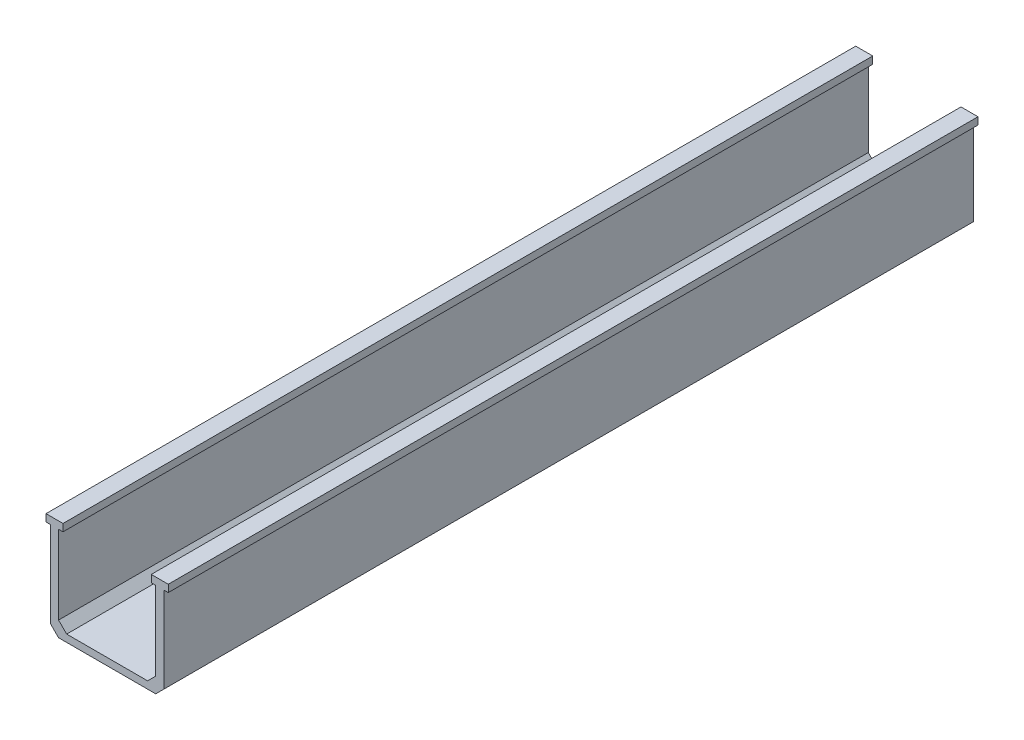
ISO-10303-21;
HEADER;
FILE_DESCRIPTION(('STEP AP214'),'2;1');
FILE_NAME('part.step','',(''),(''),'','','');
FILE_SCHEMA(('AUTOMOTIVE_DESIGN { 1 0 10303 214 1 1 1 1 }'));
ENDSEC;
DATA;
#1=APPLICATION_CONTEXT('core data for automotive mechanical design processes');
#2=APPLICATION_PROTOCOL_DEFINITION('international standard','automotive_design',2000,#1);
#3=PRODUCT_CONTEXT('',#1,'mechanical');
#4=PRODUCT('Part','Part','',(#3));
#5=PRODUCT_RELATED_PRODUCT_CATEGORY('part','',(#4));
#6=PRODUCT_DEFINITION_FORMATION('','',#4);
#7=PRODUCT_DEFINITION_CONTEXT('part definition',#1,'design');
#8=PRODUCT_DEFINITION('design','',#6,#7);
#9=PRODUCT_DEFINITION_SHAPE('','',#8);
#10=(LENGTH_UNIT() NAMED_UNIT(*) SI_UNIT(.MILLI.,.METRE.));
#11=(NAMED_UNIT(*) PLANE_ANGLE_UNIT() SI_UNIT($,.RADIAN.));
#12=(NAMED_UNIT(*) SI_UNIT($,.STERADIAN.) SOLID_ANGLE_UNIT());
#13=UNCERTAINTY_MEASURE_WITH_UNIT(LENGTH_MEASURE(1.E-05),#10,'distance_accuracy_value','');
#14=(GEOMETRIC_REPRESENTATION_CONTEXT(3) GLOBAL_UNCERTAINTY_ASSIGNED_CONTEXT((#13)) GLOBAL_UNIT_ASSIGNED_CONTEXT((#10,
#11,#12)) REPRESENTATION_CONTEXT('',''));
#15=CARTESIAN_POINT('',(0.,0.,0.));
#16=DIRECTION('',(0.,0.,1.));
#17=DIRECTION('',(1.,0.,0.));
#18=AXIS2_PLACEMENT_3D('',#15,#16,#17);
#19=CARTESIAN_POINT('',(0.,10.7142857142857,200.));
#20=DIRECTION('',(0.,-1.,0.));
#21=DIRECTION('',(0.,0.,-1.));
#22=AXIS2_PLACEMENT_3D('',#19,#20,#21);
#23=PLANE('',#22);
#24=DIRECTION('',(-1.,0.,0.));
#25=VECTOR('',#24,1.);
#26=CARTESIAN_POINT('',(0.,10.7142857142857,0.));
#27=LINE('',#26,#25);
#28=CARTESIAN_POINT('',(-14.,10.7142857142857,0.));
#29=VERTEX_POINT('',#28);
#30=CARTESIAN_POINT('',(-15.100215679252,10.7142857142857,0.));
#31=VERTEX_POINT('',#30);
#32=EDGE_CURVE('E188',#29,#31,#27,.T.);
#33=ORIENTED_EDGE('',*,*,#32,.F.);
#34=DIRECTION('',(0.,0.,-1.));
#35=VECTOR('',#34,1.);
#36=CARTESIAN_POINT('',(-14.,10.7142857142857,200.));
#37=LINE('',#36,#35);
#38=CARTESIAN_POINT('',(-14.,10.7142857142857,200.));
#39=VERTEX_POINT('',#38);
#40=EDGE_CURVE('E174',#39,#29,#37,.T.);
#41=ORIENTED_EDGE('',*,*,#40,.F.);
#42=DIRECTION('',(-1.,0.,0.));
#43=VECTOR('',#42,1.);
#44=CARTESIAN_POINT('',(0.,10.7142857142857,200.));
#45=LINE('',#44,#43);
#46=CARTESIAN_POINT('',(-15.100215679252,10.7142857142857,200.));
#47=VERTEX_POINT('',#46);
#48=EDGE_CURVE('E182',#39,#47,#45,.T.);
#49=ORIENTED_EDGE('',*,*,#48,.T.);
#50=DIRECTION('',(0.,0.,-1.));
#51=VECTOR('',#50,1.);
#52=CARTESIAN_POINT('',(-15.100215679252,10.7142857142857,200.));
#53=LINE('',#52,#51);
#54=EDGE_CURVE('E237',#47,#31,#53,.T.);
#55=ORIENTED_EDGE('',*,*,#54,.T.);
#56=EDGE_LOOP('',(#33,#41,#49,#55));
#57=FACE_BOUND('',#56,.T.);
#58=ADVANCED_FACE('F34',(#57),#23,.T.);
#59=CARTESIAN_POINT('',(-14.0000000000001,1.39140835605427E-13,200.));
#60=DIRECTION('',(-1.,0.,0.));
#61=DIRECTION('',(0.,-1.,0.));
#62=AXIS2_PLACEMENT_3D('',#59,#60,#61);
#63=PLANE('',#62);
#64=DIRECTION('',(0.,1.,0.));
#65=VECTOR('',#64,1.);
#66=CARTESIAN_POINT('',(-14.0000000000001,1.39140835605427E-13,0.));
#67=LINE('',#66,#65);
#68=CARTESIAN_POINT('',(-14.0000000000002,-10.5,0.));
#69=VERTEX_POINT('',#68);
#70=EDGE_CURVE('E239',#69,#29,#67,.T.);
#71=ORIENTED_EDGE('',*,*,#70,.F.);
#72=DIRECTION('',(0.,0.,1.));
#73=VECTOR('',#72,1.);
#74=CARTESIAN_POINT('',(-14.0000000000002,-10.5,200.));
#75=LINE('',#74,#73);
#76=CARTESIAN_POINT('',(-14.0000000000002,-10.5,200.));
#77=VERTEX_POINT('',#76);
#78=EDGE_CURVE('E177',#69,#77,#75,.T.);
#79=ORIENTED_EDGE('',*,*,#78,.T.);
#80=DIRECTION('',(0.,1.,0.));
#81=VECTOR('',#80,1.);
#82=CARTESIAN_POINT('',(-14.0000000000001,1.39140835605427E-13,200.));
#83=LINE('',#82,#81);
#84=EDGE_CURVE('E170',#77,#39,#83,.T.);
#85=ORIENTED_EDGE('',*,*,#84,.T.);
#86=ORIENTED_EDGE('',*,*,#40,.T.);
#87=EDGE_LOOP('',(#71,#79,#85,#86));
#88=FACE_BOUND('',#87,.T.);
#89=ADVANCED_FACE('F173',(#88),#63,.T.);
#90=CARTESIAN_POINT('',(0.,-12.5,200.));
#91=DIRECTION('',(0.,1.,0.));
#92=DIRECTION('',(-1.,0.,0.));
#93=AXIS2_PLACEMENT_3D('',#90,#91,#92);
#94=PLANE('',#93);
#95=CARTESIAN_POINT('',(-1.07119396054503E-13,-12.5,24.9996189974107));
#96=DIRECTION('',(0.,1.,0.));
#97=DIRECTION('',(-1.,0.,0.));
#98=AXIS2_PLACEMENT_3D('',#95,#96,#97);
#99=CIRCLE('',#98,3.);
#100=CARTESIAN_POINT('',(-3.00000000000011,-12.5,24.9996189974107));
#101=VERTEX_POINT('',#100);
#102=EDGE_CURVE('E202',#101,#101,#99,.T.);
#103=ORIENTED_EDGE('',*,*,#102,.T.);
#104=EDGE_LOOP('',(#103));
#105=FACE_BOUND('',#104,.T.);
#106=CARTESIAN_POINT('',(-1.07119396054503E-13,-12.5,175.000381002589));
#107=DIRECTION('',(0.,1.,0.));
#108=DIRECTION('',(-1.,0.,0.));
#109=AXIS2_PLACEMENT_3D('',#106,#107,#108);
#110=CIRCLE('',#109,3.);
#111=CARTESIAN_POINT('',(-3.00000000000011,-12.5,175.000381002589));
#112=VERTEX_POINT('',#111);
#113=EDGE_CURVE('E322',#112,#112,#110,.T.);
#114=ORIENTED_EDGE('',*,*,#113,.T.);
#115=EDGE_LOOP('',(#114));
#116=FACE_BOUND('',#115,.T.);
#117=CARTESIAN_POINT('',(0.,-12.5,100.));
#118=DIRECTION('',(0.,1.,0.));
#119=DIRECTION('',(-1.,0.,0.));
#120=AXIS2_PLACEMENT_3D('',#117,#118,#119);
#121=CIRCLE('',#120,3.);
#122=CARTESIAN_POINT('',(-3.00000000000006,-12.5,100.));
#123=VERTEX_POINT('',#122);
#124=EDGE_CURVE('E318',#123,#123,#121,.T.);
#125=ORIENTED_EDGE('',*,*,#124,.T.);
#126=EDGE_LOOP('',(#125));
#127=FACE_BOUND('',#126,.T.);
#128=DIRECTION('',(1.,0.,0.));
#129=VECTOR('',#128,1.);
#130=CARTESIAN_POINT('',(0.,-12.5,200.));
#131=LINE('',#130,#129);
#132=CARTESIAN_POINT('',(-12.0000000000003,-12.5,200.));
#133=VERTEX_POINT('',#132);
#134=CARTESIAN_POINT('',(12.,-12.5,200.));
#135=VERTEX_POINT('',#134);
#136=EDGE_CURVE('E181',#133,#135,#131,.T.);
#137=ORIENTED_EDGE('',*,*,#136,.F.);
#138=DIRECTION('',(0.,0.,-1.));
#139=VECTOR('',#138,1.);
#140=CARTESIAN_POINT('',(-12.0000000000003,-12.5,0.));
#141=LINE('',#140,#139);
#142=CARTESIAN_POINT('',(-12.0000000000003,-12.5,0.));
#143=VERTEX_POINT('',#142);
#144=EDGE_CURVE('E299',#133,#143,#141,.T.);
#145=ORIENTED_EDGE('',*,*,#144,.T.);
#146=DIRECTION('',(1.,0.,0.));
#147=VECTOR('',#146,1.);
#148=CARTESIAN_POINT('',(0.,-12.5,0.));
#149=LINE('',#148,#147);
#150=CARTESIAN_POINT('',(12.,-12.5,0.));
#151=VERTEX_POINT('',#150);
#152=EDGE_CURVE('E241',#143,#151,#149,.T.);
#153=ORIENTED_EDGE('',*,*,#152,.T.);
#154=DIRECTION('',(0.,0.,1.));
#155=VECTOR('',#154,1.);
#156=CARTESIAN_POINT('',(12.,-12.5,200.));
#157=LINE('',#156,#155);
#158=EDGE_CURVE('E189',#151,#135,#157,.T.);
#159=ORIENTED_EDGE('',*,*,#158,.T.);
#160=EDGE_LOOP('',(#137,#145,#153,#159));
#161=FACE_BOUND('',#160,.T.);
#162=ADVANCED_FACE('F369',(#105,#116,#127,#161),#94,.F.);
#163=CARTESIAN_POINT('',(14.,0.,200.));
#164=DIRECTION('',(-1.,0.,0.));
#165=DIRECTION('',(0.,0.,1.));
#166=AXIS2_PLACEMENT_3D('',#163,#164,#165);
#167=PLANE('',#166);
#168=DIRECTION('',(0.,1.,0.));
#169=VECTOR('',#168,1.);
#170=CARTESIAN_POINT('',(14.,0.,200.));
#171=LINE('',#170,#169);
#172=CARTESIAN_POINT('',(14.,-10.5,200.));
#173=VERTEX_POINT('',#172);
#174=CARTESIAN_POINT('',(14.,10.7142857142857,200.));
#175=VERTEX_POINT('',#174);
#176=EDGE_CURVE('E207',#173,#175,#171,.T.);
#177=ORIENTED_EDGE('',*,*,#176,.F.);
#178=DIRECTION('',(0.,0.,-1.));
#179=VECTOR('',#178,1.);
#180=CARTESIAN_POINT('',(14.,-10.5,200.));
#181=LINE('',#180,#179);
#182=CARTESIAN_POINT('',(14.,-10.5,0.));
#183=VERTEX_POINT('',#182);
#184=EDGE_CURVE('E311',#173,#183,#181,.T.);
#185=ORIENTED_EDGE('',*,*,#184,.T.);
#186=DIRECTION('',(0.,1.,0.));
#187=VECTOR('',#186,1.);
#188=CARTESIAN_POINT('',(14.,0.,0.));
#189=LINE('',#188,#187);
#190=CARTESIAN_POINT('',(14.,10.7142857142857,0.));
#191=VERTEX_POINT('',#190);
#192=EDGE_CURVE('E244',#183,#191,#189,.T.);
#193=ORIENTED_EDGE('',*,*,#192,.T.);
#194=DIRECTION('',(0.,0.,-1.));
#195=VECTOR('',#194,1.);
#196=CARTESIAN_POINT('',(14.,10.7142857142857,200.));
#197=LINE('',#196,#195);
#198=EDGE_CURVE('E190',#175,#191,#197,.T.);
#199=ORIENTED_EDGE('',*,*,#198,.F.);
#200=EDGE_LOOP('',(#177,#185,#193,#199));
#201=FACE_BOUND('',#200,.T.);
#202=ADVANCED_FACE('F405',(#201),#167,.F.);
#203=CARTESIAN_POINT('',(0.,10.7142857142857,200.));
#204=DIRECTION('',(0.,1.,0.));
#205=DIRECTION('',(-1.,0.,0.));
#206=AXIS2_PLACEMENT_3D('',#203,#204,#205);
#207=PLANE('',#206);
#208=DIRECTION('',(1.,0.,0.));
#209=VECTOR('',#208,1.);
#210=CARTESIAN_POINT('',(0.,10.7142857142857,0.));
#211=LINE('',#210,#209);
#212=CARTESIAN_POINT('',(15.100215679252,10.7142857142857,0.));
#213=VERTEX_POINT('',#212);
#214=EDGE_CURVE('E246',#191,#213,#211,.T.);
#215=ORIENTED_EDGE('',*,*,#214,.T.);
#216=DIRECTION('',(0.,0.,-1.));
#217=VECTOR('',#216,1.);
#218=CARTESIAN_POINT('',(15.100215679252,10.7142857142857,200.));
#219=LINE('',#218,#217);
#220=CARTESIAN_POINT('',(15.100215679252,10.7142857142857,200.));
#221=VERTEX_POINT('',#220);
#222=EDGE_CURVE('E293',#221,#213,#219,.T.);
#223=ORIENTED_EDGE('',*,*,#222,.F.);
#224=DIRECTION('',(1.,0.,0.));
#225=VECTOR('',#224,1.);
#226=CARTESIAN_POINT('',(0.,10.7142857142857,200.));
#227=LINE('',#226,#225);
#228=EDGE_CURVE('E209',#175,#221,#227,.T.);
#229=ORIENTED_EDGE('',*,*,#228,.F.);
#230=ORIENTED_EDGE('',*,*,#198,.T.);
#231=EDGE_LOOP('',(#215,#223,#229,#230));
#232=FACE_BOUND('',#231,.T.);
#233=ADVANCED_FACE('F411',(#232),#207,.F.);
#234=CARTESIAN_POINT('',(15.100215679252,0.,200.));
#235=DIRECTION('',(-1.,0.,0.));
#236=DIRECTION('',(0.,-1.,0.));
#237=AXIS2_PLACEMENT_3D('',#234,#235,#236);
#238=PLANE('',#237);
#239=DIRECTION('',(0.,1.,0.));
#240=VECTOR('',#239,1.);
#241=CARTESIAN_POINT('',(15.100215679252,0.,0.));
#242=LINE('',#241,#240);
#243=CARTESIAN_POINT('',(15.100215679252,12.5,0.));
#244=VERTEX_POINT('',#243);
#245=EDGE_CURVE('E248',#213,#244,#242,.T.);
#246=ORIENTED_EDGE('',*,*,#245,.T.);
#247=DIRECTION('',(0.,0.,-1.));
#248=VECTOR('',#247,1.);
#249=CARTESIAN_POINT('',(15.100215679252,12.5,200.));
#250=LINE('',#249,#248);
#251=CARTESIAN_POINT('',(15.100215679252,12.5,200.));
#252=VERTEX_POINT('',#251);
#253=EDGE_CURVE('E291',#252,#244,#250,.T.);
#254=ORIENTED_EDGE('',*,*,#253,.F.);
#255=DIRECTION('',(0.,1.,0.));
#256=VECTOR('',#255,1.);
#257=CARTESIAN_POINT('',(15.100215679252,0.,200.));
#258=LINE('',#257,#256);
#259=EDGE_CURVE('E211',#221,#252,#258,.T.);
#260=ORIENTED_EDGE('',*,*,#259,.F.);
#261=ORIENTED_EDGE('',*,*,#222,.T.);
#262=EDGE_LOOP('',(#246,#254,#260,#261));
#263=FACE_BOUND('',#262,.T.);
#264=ADVANCED_FACE('F417',(#263),#238,.F.);
#265=CARTESIAN_POINT('',(0.,12.5,200.));
#266=DIRECTION('',(0.,1.,0.));
#267=DIRECTION('',(-1.,0.,0.));
#268=AXIS2_PLACEMENT_3D('',#265,#266,#267);
#269=PLANE('',#268);
#270=DIRECTION('',(1.,0.,0.));
#271=VECTOR('',#270,1.);
#272=CARTESIAN_POINT('',(0.,12.5,0.));
#273=LINE('',#272,#271);
#274=CARTESIAN_POINT('',(10.899784320748,12.5,0.));
#275=VERTEX_POINT('',#274);
#276=EDGE_CURVE('E251',#275,#244,#273,.T.);
#277=ORIENTED_EDGE('',*,*,#276,.F.);
#278=DIRECTION('',(0.,0.,-1.));
#279=VECTOR('',#278,1.);
#280=CARTESIAN_POINT('',(10.899784320748,12.5,200.));
#281=LINE('',#280,#279);
#282=CARTESIAN_POINT('',(10.899784320748,12.5,200.));
#283=VERTEX_POINT('',#282);
#284=EDGE_CURVE('E289',#283,#275,#281,.T.);
#285=ORIENTED_EDGE('',*,*,#284,.F.);
#286=DIRECTION('',(1.,0.,0.));
#287=VECTOR('',#286,1.);
#288=CARTESIAN_POINT('',(0.,12.5,200.));
#289=LINE('',#288,#287);
#290=EDGE_CURVE('E213',#283,#252,#289,.T.);
#291=ORIENTED_EDGE('',*,*,#290,.T.);
#292=ORIENTED_EDGE('',*,*,#253,.T.);
#293=EDGE_LOOP('',(#277,#285,#291,#292));
#294=FACE_BOUND('',#293,.T.);
#295=ADVANCED_FACE('F421',(#294),#269,.T.);
#296=CARTESIAN_POINT('',(10.8997843207481,0.,200.));
#297=DIRECTION('',(-1.,0.,0.));
#298=DIRECTION('',(0.,-1.,0.));
#299=AXIS2_PLACEMENT_3D('',#296,#297,#298);
#300=PLANE('',#299);
#301=DIRECTION('',(0.,1.,0.));
#302=VECTOR('',#301,1.);
#303=CARTESIAN_POINT('',(10.8997843207481,0.,0.));
#304=LINE('',#303,#302);
#305=CARTESIAN_POINT('',(10.899784320748,10.7142857142857,0.));
#306=VERTEX_POINT('',#305);
#307=EDGE_CURVE('E254',#306,#275,#304,.T.);
#308=ORIENTED_EDGE('',*,*,#307,.F.);
#309=DIRECTION('',(0.,0.,-1.));
#310=VECTOR('',#309,1.);
#311=CARTESIAN_POINT('',(10.899784320748,10.7142857142857,200.));
#312=LINE('',#311,#310);
#313=CARTESIAN_POINT('',(10.899784320748,10.7142857142857,200.));
#314=VERTEX_POINT('',#313);
#315=EDGE_CURVE('E287',#314,#306,#312,.T.);
#316=ORIENTED_EDGE('',*,*,#315,.F.);
#317=DIRECTION('',(0.,1.,0.));
#318=VECTOR('',#317,1.);
#319=CARTESIAN_POINT('',(10.8997843207481,0.,200.));
#320=LINE('',#319,#318);
#321=EDGE_CURVE('E216',#314,#283,#320,.T.);
#322=ORIENTED_EDGE('',*,*,#321,.T.);
#323=ORIENTED_EDGE('',*,*,#284,.T.);
#324=EDGE_LOOP('',(#308,#316,#322,#323));
#325=FACE_BOUND('',#324,.T.);
#326=ADVANCED_FACE('F424',(#325),#300,.T.);
#327=CARTESIAN_POINT('',(2.02720139049807E-13,10.7142857142859,200.));
#328=DIRECTION('',(0.,1.,0.));
#329=DIRECTION('',(-1.,0.,0.));
#330=AXIS2_PLACEMENT_3D('',#327,#328,#329);
#331=PLANE('',#330);
#332=DIRECTION('',(1.,0.,0.));
#333=VECTOR('',#332,1.);
#334=CARTESIAN_POINT('',(2.02720139049807E-13,10.7142857142859,0.));
#335=LINE('',#334,#333);
#336=CARTESIAN_POINT('',(12.,10.7142857142857,0.));
#337=VERTEX_POINT('',#336);
#338=EDGE_CURVE('E257',#306,#337,#335,.T.);
#339=ORIENTED_EDGE('',*,*,#338,.T.);
#340=DIRECTION('',(0.,0.,-1.));
#341=VECTOR('',#340,1.);
#342=CARTESIAN_POINT('',(12.,10.7142857142857,200.));
#343=LINE('',#342,#341);
#344=CARTESIAN_POINT('',(12.,10.7142857142857,200.));
#345=VERTEX_POINT('',#344);
#346=EDGE_CURVE('E284',#345,#337,#343,.T.);
#347=ORIENTED_EDGE('',*,*,#346,.F.);
#348=DIRECTION('',(1.,0.,0.));
#349=VECTOR('',#348,1.);
#350=CARTESIAN_POINT('',(2.02720139049807E-13,10.7142857142859,200.));
#351=LINE('',#350,#349);
#352=EDGE_CURVE('E219',#314,#345,#351,.T.);
#353=ORIENTED_EDGE('',*,*,#352,.F.);
#354=ORIENTED_EDGE('',*,*,#315,.T.);
#355=EDGE_LOOP('',(#339,#347,#353,#354));
#356=FACE_BOUND('',#355,.T.);
#357=ADVANCED_FACE('F428',(#356),#331,.F.);
#358=CARTESIAN_POINT('',(12.,0.,200.));
#359=DIRECTION('',(-1.,0.,0.));
#360=DIRECTION('',(0.,0.,1.));
#361=AXIS2_PLACEMENT_3D('',#358,#359,#360);
#362=PLANE('',#361);
#363=DIRECTION('',(0.,1.,0.));
#364=VECTOR('',#363,1.);
#365=CARTESIAN_POINT('',(12.,0.,0.));
#366=LINE('',#365,#364);
#367=CARTESIAN_POINT('',(12.,-8.71428571428572,0.));
#368=VERTEX_POINT('',#367);
#369=EDGE_CURVE('E260',#368,#337,#366,.T.);
#370=ORIENTED_EDGE('',*,*,#369,.F.);
#371=DIRECTION('',(0.,0.,1.));
#372=VECTOR('',#371,1.);
#373=CARTESIAN_POINT('',(12.,-8.71428571428572,200.));
#374=LINE('',#373,#372);
#375=CARTESIAN_POINT('',(12.,-8.71428571428572,200.));
#376=VERTEX_POINT('',#375);
#377=EDGE_CURVE('E50',#368,#376,#374,.T.);
#378=ORIENTED_EDGE('',*,*,#377,.T.);
#379=DIRECTION('',(0.,1.,0.));
#380=VECTOR('',#379,1.);
#381=CARTESIAN_POINT('',(12.,0.,200.));
#382=LINE('',#381,#380);
#383=EDGE_CURVE('E222',#376,#345,#382,.T.);
#384=ORIENTED_EDGE('',*,*,#383,.T.);
#385=ORIENTED_EDGE('',*,*,#346,.T.);
#386=EDGE_LOOP('',(#370,#378,#384,#385));
#387=FACE_BOUND('',#386,.T.);
#388=ADVANCED_FACE('F430',(#387),#362,.T.);
#389=CARTESIAN_POINT('',(0.,-10.7142857142857,200.));
#390=DIRECTION('',(0.,1.,0.));
#391=DIRECTION('',(0.,0.,1.));
#392=AXIS2_PLACEMENT_3D('',#389,#390,#391);
#393=PLANE('',#392);
#394=CARTESIAN_POINT('',(-1.06344965931299E-13,-10.7142857142857,24.9996189974107));
#395=DIRECTION('',(0.,1.,0.));
#396=DIRECTION('',(0.,0.,1.));
#397=AXIS2_PLACEMENT_3D('',#394,#395,#396);
#398=CIRCLE('',#397,3.);
#399=CARTESIAN_POINT('',(-1.06344965931299E-13,-10.7142857142857,27.9996189974107));
#400=VERTEX_POINT('',#399);
#401=EDGE_CURVE('E323',#400,#400,#398,.T.);
#402=ORIENTED_EDGE('',*,*,#401,.F.);
#403=EDGE_LOOP('',(#402));
#404=FACE_BOUND('',#403,.T.);
#405=CARTESIAN_POINT('',(-1.06344965931299E-13,-10.7142857142857,175.000381002589));
#406=DIRECTION('',(0.,1.,0.));
#407=DIRECTION('',(0.,0.,1.));
#408=AXIS2_PLACEMENT_3D('',#405,#406,#407);
#409=CIRCLE('',#408,3.);
#410=CARTESIAN_POINT('',(-1.06344965931299E-13,-10.7142857142857,178.000381002589));
#411=VERTEX_POINT('',#410);
#412=EDGE_CURVE('E319',#411,#411,#409,.T.);
#413=ORIENTED_EDGE('',*,*,#412,.F.);
#414=EDGE_LOOP('',(#413));
#415=FACE_BOUND('',#414,.T.);
#416=CARTESIAN_POINT('',(0.,-10.7142857142857,100.));
#417=DIRECTION('',(0.,1.,0.));
#418=DIRECTION('',(0.,0.,1.));
#419=AXIS2_PLACEMENT_3D('',#416,#417,#418);
#420=CIRCLE('',#419,3.);
#421=CARTESIAN_POINT('',(0.,-10.7142857142857,103.));
#422=VERTEX_POINT('',#421);
#423=EDGE_CURVE('E315',#422,#422,#420,.T.);
#424=ORIENTED_EDGE('',*,*,#423,.F.);
#425=EDGE_LOOP('',(#424));
#426=FACE_BOUND('',#425,.T.);
#427=DIRECTION('',(1.,0.,0.));
#428=VECTOR('',#427,1.);
#429=CARTESIAN_POINT('',(0.,-10.7142857142857,200.));
#430=LINE('',#429,#428);
#431=CARTESIAN_POINT('',(-10.,-10.7142857142857,200.));
#432=VERTEX_POINT('',#431);
#433=CARTESIAN_POINT('',(10.,-10.7142857142857,200.));
#434=VERTEX_POINT('',#433);
#435=EDGE_CURVE('E224',#432,#434,#430,.T.);
#436=ORIENTED_EDGE('',*,*,#435,.T.);
#437=DIRECTION('',(0.,0.,-1.));
#438=VECTOR('',#437,1.);
#439=CARTESIAN_POINT('',(10.,-10.7142857142857,0.));
#440=LINE('',#439,#438);
#441=CARTESIAN_POINT('',(10.,-10.7142857142857,0.));
#442=VERTEX_POINT('',#441);
#443=EDGE_CURVE('E334',#434,#442,#440,.T.);
#444=ORIENTED_EDGE('',*,*,#443,.T.);
#445=DIRECTION('',(1.,0.,0.));
#446=VECTOR('',#445,1.);
#447=CARTESIAN_POINT('',(0.,-10.7142857142857,0.));
#448=LINE('',#447,#446);
#449=CARTESIAN_POINT('',(-10.,-10.7142857142857,0.));
#450=VERTEX_POINT('',#449);
#451=EDGE_CURVE('E262',#450,#442,#448,.T.);
#452=ORIENTED_EDGE('',*,*,#451,.F.);
#453=DIRECTION('',(0.,0.,1.));
#454=VECTOR('',#453,1.);
#455=CARTESIAN_POINT('',(-10.,-10.7142857142857,200.));
#456=LINE('',#455,#454);
#457=EDGE_CURVE('E328',#450,#432,#456,.T.);
#458=ORIENTED_EDGE('',*,*,#457,.T.);
#459=EDGE_LOOP('',(#436,#444,#452,#458));
#460=FACE_BOUND('',#459,.T.);
#461=ADVANCED_FACE('F340',(#404,#415,#426,#460),#393,.T.);
#462=CARTESIAN_POINT('',(-12.,0.,200.));
#463=DIRECTION('',(-1.,0.,0.));
#464=DIRECTION('',(0.,0.,1.));
#465=AXIS2_PLACEMENT_3D('',#462,#463,#464);
#466=PLANE('',#465);
#467=DIRECTION('',(0.,1.,0.));
#468=VECTOR('',#467,1.);
#469=CARTESIAN_POINT('',(-12.,0.,200.));
#470=LINE('',#469,#468);
#471=CARTESIAN_POINT('',(-12.,-8.71428571428572,200.));
#472=VERTEX_POINT('',#471);
#473=CARTESIAN_POINT('',(-12.,10.7142857142857,200.));
#474=VERTEX_POINT('',#473);
#475=EDGE_CURVE('E227',#472,#474,#470,.T.);
#476=ORIENTED_EDGE('',*,*,#475,.F.);
#477=DIRECTION('',(0.,0.,-1.));
#478=VECTOR('',#477,1.);
#479=CARTESIAN_POINT('',(-12.,-8.71428571428572,200.));
#480=LINE('',#479,#478);
#481=CARTESIAN_POINT('',(-12.,-8.71428571428572,0.));
#482=VERTEX_POINT('',#481);
#483=EDGE_CURVE('E314',#472,#482,#480,.T.);
#484=ORIENTED_EDGE('',*,*,#483,.T.);
#485=DIRECTION('',(0.,1.,0.));
#486=VECTOR('',#485,1.);
#487=CARTESIAN_POINT('',(-12.,0.,0.));
#488=LINE('',#487,#486);
#489=CARTESIAN_POINT('',(-12.,10.7142857142857,0.));
#490=VERTEX_POINT('',#489);
#491=EDGE_CURVE('E264',#482,#490,#488,.T.);
#492=ORIENTED_EDGE('',*,*,#491,.T.);
#493=DIRECTION('',(0.,0.,-1.));
#494=VECTOR('',#493,1.);
#495=CARTESIAN_POINT('',(-12.,10.7142857142857,200.));
#496=LINE('',#495,#494);
#497=EDGE_CURVE('E281',#474,#490,#496,.T.);
#498=ORIENTED_EDGE('',*,*,#497,.F.);
#499=EDGE_LOOP('',(#476,#484,#492,#498));
#500=FACE_BOUND('',#499,.T.);
#501=ADVANCED_FACE('F355',(#500),#466,.F.);
#502=CARTESIAN_POINT('',(0.,10.7142857142857,200.));
#503=DIRECTION('',(0.,1.,0.));
#504=DIRECTION('',(0.,0.,1.));
#505=AXIS2_PLACEMENT_3D('',#502,#503,#504);
#506=PLANE('',#505);
#507=DIRECTION('',(1.,0.,0.));
#508=VECTOR('',#507,1.);
#509=CARTESIAN_POINT('',(0.,10.7142857142857,0.));
#510=LINE('',#509,#508);
#511=CARTESIAN_POINT('',(-10.899784320748,10.7142857142857,0.));
#512=VERTEX_POINT('',#511);
#513=EDGE_CURVE('E266',#490,#512,#510,.T.);
#514=ORIENTED_EDGE('',*,*,#513,.T.);
#515=DIRECTION('',(0.,0.,-1.));
#516=VECTOR('',#515,1.);
#517=CARTESIAN_POINT('',(-10.899784320748,10.7142857142857,200.));
#518=LINE('',#517,#516);
#519=CARTESIAN_POINT('',(-10.899784320748,10.7142857142857,200.));
#520=VERTEX_POINT('',#519);
#521=EDGE_CURVE('E278',#520,#512,#518,.T.);
#522=ORIENTED_EDGE('',*,*,#521,.F.);
#523=DIRECTION('',(1.,0.,0.));
#524=VECTOR('',#523,1.);
#525=CARTESIAN_POINT('',(0.,10.7142857142857,200.));
#526=LINE('',#525,#524);
#527=EDGE_CURVE('E229',#474,#520,#526,.T.);
#528=ORIENTED_EDGE('',*,*,#527,.F.);
#529=ORIENTED_EDGE('',*,*,#497,.T.);
#530=EDGE_LOOP('',(#514,#522,#528,#529));
#531=FACE_BOUND('',#530,.T.);
#532=ADVANCED_FACE('F445',(#531),#506,.F.);
#533=CARTESIAN_POINT('',(-10.899784320748,0.,200.));
#534=DIRECTION('',(-1.,0.,0.));
#535=DIRECTION('',(0.,0.,1.));
#536=AXIS2_PLACEMENT_3D('',#533,#534,#535);
#537=PLANE('',#536);
#538=DIRECTION('',(0.,1.,0.));
#539=VECTOR('',#538,1.);
#540=CARTESIAN_POINT('',(-10.899784320748,0.,0.));
#541=LINE('',#540,#539);
#542=CARTESIAN_POINT('',(-10.899784320748,12.5,0.));
#543=VERTEX_POINT('',#542);
#544=EDGE_CURVE('E268',#512,#543,#541,.T.);
#545=ORIENTED_EDGE('',*,*,#544,.T.);
#546=DIRECTION('',(0.,0.,-1.));
#547=VECTOR('',#546,1.);
#548=CARTESIAN_POINT('',(-10.899784320748,12.5,200.));
#549=LINE('',#548,#547);
#550=CARTESIAN_POINT('',(-10.899784320748,12.5,200.));
#551=VERTEX_POINT('',#550);
#552=EDGE_CURVE('E276',#551,#543,#549,.T.);
#553=ORIENTED_EDGE('',*,*,#552,.F.);
#554=DIRECTION('',(0.,1.,0.));
#555=VECTOR('',#554,1.);
#556=CARTESIAN_POINT('',(-10.899784320748,0.,200.));
#557=LINE('',#556,#555);
#558=EDGE_CURVE('E231',#520,#551,#557,.T.);
#559=ORIENTED_EDGE('',*,*,#558,.F.);
#560=ORIENTED_EDGE('',*,*,#521,.T.);
#561=EDGE_LOOP('',(#545,#553,#559,#560));
#562=FACE_BOUND('',#561,.T.);
#563=ADVANCED_FACE('F442',(#562),#537,.F.);
#564=CARTESIAN_POINT('',(0.,12.5,200.));
#565=DIRECTION('',(0.,1.,0.));
#566=DIRECTION('',(0.,0.,1.));
#567=AXIS2_PLACEMENT_3D('',#564,#565,#566);
#568=PLANE('',#567);
#569=DIRECTION('',(1.,0.,0.));
#570=VECTOR('',#569,1.);
#571=CARTESIAN_POINT('',(0.,12.5,0.));
#572=LINE('',#571,#570);
#573=CARTESIAN_POINT('',(-15.100215679252,12.5,0.));
#574=VERTEX_POINT('',#573);
#575=EDGE_CURVE('E199',#574,#543,#572,.T.);
#576=ORIENTED_EDGE('',*,*,#575,.F.);
#577=DIRECTION('',(0.,0.,-1.));
#578=VECTOR('',#577,1.);
#579=CARTESIAN_POINT('',(-15.100215679252,12.5,200.));
#580=LINE('',#579,#578);
#581=CARTESIAN_POINT('',(-15.100215679252,12.5,200.));
#582=VERTEX_POINT('',#581);
#583=EDGE_CURVE('E274',#582,#574,#580,.T.);
#584=ORIENTED_EDGE('',*,*,#583,.F.);
#585=DIRECTION('',(1.,0.,0.));
#586=VECTOR('',#585,1.);
#587=CARTESIAN_POINT('',(0.,12.5,200.));
#588=LINE('',#587,#586);
#589=EDGE_CURVE('E233',#582,#551,#588,.T.);
#590=ORIENTED_EDGE('',*,*,#589,.T.);
#591=ORIENTED_EDGE('',*,*,#552,.T.);
#592=EDGE_LOOP('',(#576,#584,#590,#591));
#593=FACE_BOUND('',#592,.T.);
#594=ADVANCED_FACE('F438',(#593),#568,.T.);
#595=CARTESIAN_POINT('',(-15.100215679252,0.,200.));
#596=DIRECTION('',(-1.,0.,0.));
#597=DIRECTION('',(0.,0.,1.));
#598=AXIS2_PLACEMENT_3D('',#595,#596,#597);
#599=PLANE('',#598);
#600=DIRECTION('',(0.,1.,0.));
#601=VECTOR('',#600,1.);
#602=CARTESIAN_POINT('',(-15.100215679252,0.,0.));
#603=LINE('',#602,#601);
#604=EDGE_CURVE('E196',#31,#574,#603,.T.);
#605=ORIENTED_EDGE('',*,*,#604,.F.);
#606=ORIENTED_EDGE('',*,*,#54,.F.);
#607=DIRECTION('',(0.,1.,0.));
#608=VECTOR('',#607,1.);
#609=CARTESIAN_POINT('',(-15.100215679252,0.,200.));
#610=LINE('',#609,#608);
#611=EDGE_CURVE('E195',#47,#582,#610,.T.);
#612=ORIENTED_EDGE('',*,*,#611,.T.);
#613=ORIENTED_EDGE('',*,*,#583,.T.);
#614=EDGE_LOOP('',(#605,#606,#612,#613));
#615=FACE_BOUND('',#614,.T.);
#616=ADVANCED_FACE('F435',(#615),#599,.T.);
#617=CARTESIAN_POINT('',(0.,0.,200.));
#618=DIRECTION('',(0.,0.,1.));
#619=DIRECTION('',(1.,0.,0.));
#620=AXIS2_PLACEMENT_3D('',#617,#618,#619);
#621=PLANE('',#620);
#622=ORIENTED_EDGE('',*,*,#84,.F.);
#623=DIRECTION('',(0.707106781186538,-0.707106781186557,0.));
#624=VECTOR('',#623,1.);
#625=CARTESIAN_POINT('',(-12.2500000000003,-12.25,200.));
#626=LINE('',#625,#624);
#627=EDGE_CURVE('E309',#77,#133,#626,.T.);
#628=ORIENTED_EDGE('',*,*,#627,.T.);
#629=ORIENTED_EDGE('',*,*,#136,.T.);
#630=DIRECTION('',(-0.707106781186548,-0.707106781186548,0.));
#631=VECTOR('',#630,1.);
#632=CARTESIAN_POINT('',(12.25,-12.25,200.));
#633=LINE('',#632,#631);
#634=EDGE_CURVE('E307',#135,#173,#633,.F.);
#635=ORIENTED_EDGE('',*,*,#634,.T.);
#636=ORIENTED_EDGE('',*,*,#176,.T.);
#637=ORIENTED_EDGE('',*,*,#228,.T.);
#638=ORIENTED_EDGE('',*,*,#259,.T.);
#639=ORIENTED_EDGE('',*,*,#290,.F.);
#640=ORIENTED_EDGE('',*,*,#321,.F.);
#641=ORIENTED_EDGE('',*,*,#352,.T.);
#642=ORIENTED_EDGE('',*,*,#383,.F.);
#643=DIRECTION('',(0.707106781186548,0.707106781186548,0.));
#644=VECTOR('',#643,1.);
#645=CARTESIAN_POINT('',(10.,-10.7142857142857,200.));
#646=LINE('',#645,#644);
#647=EDGE_CURVE('E11',#376,#434,#646,.F.);
#648=ORIENTED_EDGE('',*,*,#647,.T.);
#649=ORIENTED_EDGE('',*,*,#435,.F.);
#650=DIRECTION('',(-0.707106781186548,0.707106781186548,0.));
#651=VECTOR('',#650,1.);
#652=CARTESIAN_POINT('',(-12.,-8.71428571428572,200.));
#653=LINE('',#652,#651);
#654=EDGE_CURVE('E332',#432,#472,#653,.T.);
#655=ORIENTED_EDGE('',*,*,#654,.T.);
#656=ORIENTED_EDGE('',*,*,#475,.T.);
#657=ORIENTED_EDGE('',*,*,#527,.T.);
#658=ORIENTED_EDGE('',*,*,#558,.T.);
#659=ORIENTED_EDGE('',*,*,#589,.F.);
#660=ORIENTED_EDGE('',*,*,#611,.F.);
#661=ORIENTED_EDGE('',*,*,#48,.F.);
#662=EDGE_LOOP('',(#622,#628,#629,#635,#636,#637,#638,#639,#640,#641,#642,#648,#649,#655,#656,
#657,#658,#659,#660,#661));
#663=FACE_BOUND('',#662,.T.);
#664=ADVANCED_FACE('F192',(#663),#621,.T.);
#665=CARTESIAN_POINT('',(0.,0.,0.));
#666=DIRECTION('',(0.,0.,1.));
#667=DIRECTION('',(1.,0.,0.));
#668=AXIS2_PLACEMENT_3D('',#665,#666,#667);
#669=PLANE('',#668);
#670=ORIENTED_EDGE('',*,*,#152,.F.);
#671=DIRECTION('',(-0.707106781186538,0.707106781186557,0.));
#672=VECTOR('',#671,1.);
#673=CARTESIAN_POINT('',(-12.0000000000003,-12.5,0.));
#674=LINE('',#673,#672);
#675=EDGE_CURVE('E304',#143,#69,#674,.T.);
#676=ORIENTED_EDGE('',*,*,#675,.T.);
#677=ORIENTED_EDGE('',*,*,#70,.T.);
#678=ORIENTED_EDGE('',*,*,#32,.T.);
#679=ORIENTED_EDGE('',*,*,#604,.T.);
#680=ORIENTED_EDGE('',*,*,#575,.T.);
#681=ORIENTED_EDGE('',*,*,#544,.F.);
#682=ORIENTED_EDGE('',*,*,#513,.F.);
#683=ORIENTED_EDGE('',*,*,#491,.F.);
#684=DIRECTION('',(0.707106781186548,-0.707106781186548,0.));
#685=VECTOR('',#684,1.);
#686=CARTESIAN_POINT('',(-10.3571428571429,-10.3571428571429,0.));
#687=LINE('',#686,#685);
#688=EDGE_CURVE('E330',#482,#450,#687,.T.);
#689=ORIENTED_EDGE('',*,*,#688,.T.);
#690=ORIENTED_EDGE('',*,*,#451,.T.);
#691=DIRECTION('',(-0.707106781186548,-0.707106781186548,0.));
#692=VECTOR('',#691,1.);
#693=CARTESIAN_POINT('',(10.3571428571429,-10.3571428571429,0.));
#694=LINE('',#693,#692);
#695=EDGE_CURVE('E43',#442,#368,#694,.F.);
#696=ORIENTED_EDGE('',*,*,#695,.T.);
#697=ORIENTED_EDGE('',*,*,#369,.T.);
#698=ORIENTED_EDGE('',*,*,#338,.F.);
#699=ORIENTED_EDGE('',*,*,#307,.T.);
#700=ORIENTED_EDGE('',*,*,#276,.T.);
#701=ORIENTED_EDGE('',*,*,#245,.F.);
#702=ORIENTED_EDGE('',*,*,#214,.F.);
#703=ORIENTED_EDGE('',*,*,#192,.F.);
#704=DIRECTION('',(0.707106781186548,0.707106781186548,0.));
#705=VECTOR('',#704,1.);
#706=CARTESIAN_POINT('',(14.,-10.5,0.));
#707=LINE('',#706,#705);
#708=EDGE_CURVE('E302',#183,#151,#707,.F.);
#709=ORIENTED_EDGE('',*,*,#708,.T.);
#710=EDGE_LOOP('',(#670,#676,#677,#678,#679,#680,#681,#682,#683,#689,#690,#696,#697,#698,#699,
#700,#701,#702,#703,#709));
#711=FACE_BOUND('',#710,.T.);
#712=ADVANCED_FACE('F346',(#711),#669,.F.);
#713=CARTESIAN_POINT('',(-12.0000000000003,-12.5,200.));
#714=DIRECTION('',(-0.707106781186557,-0.707106781186538,0.));
#715=DIRECTION('',(0.,0.,1.));
#716=AXIS2_PLACEMENT_3D('',#713,#714,#715);
#717=PLANE('',#716);
#718=ORIENTED_EDGE('',*,*,#627,.F.);
#719=ORIENTED_EDGE('',*,*,#78,.F.);
#720=ORIENTED_EDGE('',*,*,#675,.F.);
#721=ORIENTED_EDGE('',*,*,#144,.F.);
#722=EDGE_LOOP('',(#718,#719,#720,#721));
#723=FACE_BOUND('',#722,.T.);
#724=ADVANCED_FACE('F374',(#723),#717,.T.);
#725=CARTESIAN_POINT('',(14.,-10.5,200.));
#726=DIRECTION('',(-0.707106781186547,0.707106781186547,0.));
#727=DIRECTION('',(0.,0.,-1.));
#728=AXIS2_PLACEMENT_3D('',#725,#726,#727);
#729=PLANE('',#728);
#730=ORIENTED_EDGE('',*,*,#634,.F.);
#731=ORIENTED_EDGE('',*,*,#158,.F.);
#732=ORIENTED_EDGE('',*,*,#708,.F.);
#733=ORIENTED_EDGE('',*,*,#184,.F.);
#734=EDGE_LOOP('',(#730,#731,#732,#733));
#735=FACE_BOUND('',#734,.T.);
#736=ADVANCED_FACE('F380',(#735),#729,.F.);
#737=CARTESIAN_POINT('',(0.,12.5,100.));
#738=DIRECTION('',(0.,-1.,0.));
#739=DIRECTION('',(1.,0.,0.));
#740=AXIS2_PLACEMENT_3D('',#737,#738,#739);
#741=CYLINDRICAL_SURFACE('',#740,3.);
#742=ORIENTED_EDGE('',*,*,#423,.T.);
#743=EDGE_LOOP('',(#742));
#744=FACE_BOUND('',#743,.T.);
#745=ORIENTED_EDGE('',*,*,#124,.F.);
#746=EDGE_LOOP('',(#745));
#747=FACE_BOUND('',#746,.T.);
#748=ADVANCED_FACE('F386',(#744,#747),#741,.F.);
#749=CARTESIAN_POINT('',(0.,12.5,175.000381002589));
#750=DIRECTION('',(0.,-1.,0.));
#751=DIRECTION('',(1.,0.,0.));
#752=AXIS2_PLACEMENT_3D('',#749,#750,#751);
#753=CYLINDRICAL_SURFACE('',#752,3.);
#754=ORIENTED_EDGE('',*,*,#412,.T.);
#755=EDGE_LOOP('',(#754));
#756=FACE_BOUND('',#755,.T.);
#757=ORIENTED_EDGE('',*,*,#113,.F.);
#758=EDGE_LOOP('',(#757));
#759=FACE_BOUND('',#758,.T.);
#760=ADVANCED_FACE('F395',(#756,#759),#753,.F.);
#761=CARTESIAN_POINT('',(0.,12.5,24.9996189974107));
#762=DIRECTION('',(0.,-1.,0.));
#763=DIRECTION('',(1.,0.,0.));
#764=AXIS2_PLACEMENT_3D('',#761,#762,#763);
#765=CYLINDRICAL_SURFACE('',#764,3.);
#766=ORIENTED_EDGE('',*,*,#401,.T.);
#767=EDGE_LOOP('',(#766));
#768=FACE_BOUND('',#767,.T.);
#769=ORIENTED_EDGE('',*,*,#102,.F.);
#770=EDGE_LOOP('',(#769));
#771=FACE_BOUND('',#770,.T.);
#772=ADVANCED_FACE('F363',(#768,#771),#765,.F.);
#773=CARTESIAN_POINT('',(-12.,-8.71428571428572,200.));
#774=DIRECTION('',(-0.707106781186547,-0.707106781186547,0.));
#775=DIRECTION('',(0.,0.,-1.));
#776=AXIS2_PLACEMENT_3D('',#773,#774,#775);
#777=PLANE('',#776);
#778=ORIENTED_EDGE('',*,*,#654,.F.);
#779=ORIENTED_EDGE('',*,*,#457,.F.);
#780=ORIENTED_EDGE('',*,*,#688,.F.);
#781=ORIENTED_EDGE('',*,*,#483,.F.);
#782=EDGE_LOOP('',(#778,#779,#780,#781));
#783=FACE_BOUND('',#782,.T.);
#784=ADVANCED_FACE('F352',(#783),#777,.F.);
#785=CARTESIAN_POINT('',(10.,-10.7142857142857,200.));
#786=DIRECTION('',(-0.707106781186547,0.707106781186547,0.));
#787=DIRECTION('',(0.,0.,1.));
#788=AXIS2_PLACEMENT_3D('',#785,#786,#787);
#789=PLANE('',#788);
#790=ORIENTED_EDGE('',*,*,#647,.F.);
#791=ORIENTED_EDGE('',*,*,#377,.F.);
#792=ORIENTED_EDGE('',*,*,#695,.F.);
#793=ORIENTED_EDGE('',*,*,#443,.F.);
#794=EDGE_LOOP('',(#790,#791,#792,#793));
#795=FACE_BOUND('',#794,.T.);
#796=ADVANCED_FACE('F37',(#795),#789,.T.);
#797=CLOSED_SHELL('',(#58,#89,#162,#202,#233,#264,#295,#326,#357,#388,#461,#501,#532,#563,#594,
#616,#664,#712,#724,#736,#748,#760,#772,#784,#796));
#798=MANIFOLD_SOLID_BREP('B2',#797);
#799=ADVANCED_BREP_SHAPE_REPRESENTATION('',(#18,#798),#14);
#800=SHAPE_DEFINITION_REPRESENTATION(#9,#799);
ENDSEC;
END-ISO-10303-21;
